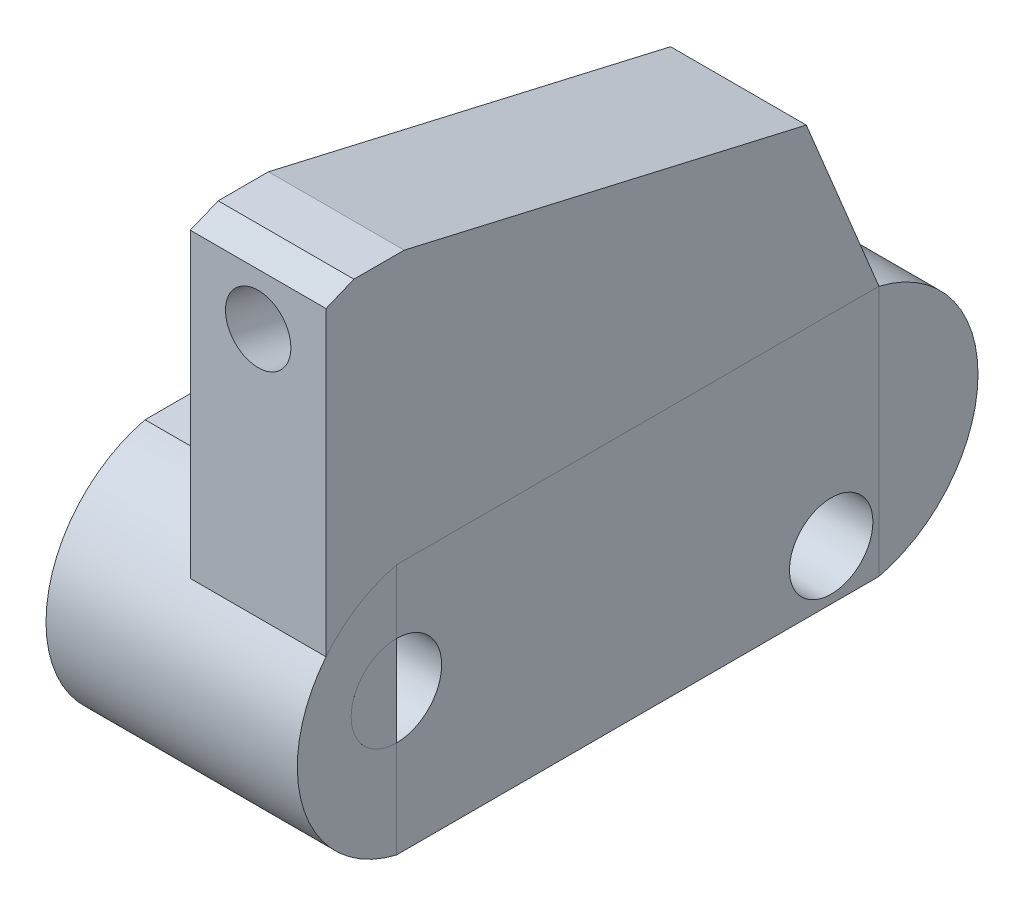
ISO-10303-21;
HEADER;
FILE_DESCRIPTION(('STEP AP214'),'2;1');
FILE_NAME('part.step','',(''),(''),'','','');
FILE_SCHEMA(('AUTOMOTIVE_DESIGN { 1 0 10303 214 1 1 1 1 }'));
ENDSEC;
DATA;
#1=APPLICATION_CONTEXT('core data for automotive mechanical design processes');
#2=APPLICATION_PROTOCOL_DEFINITION('international standard','automotive_design',2000,#1);
#3=PRODUCT_CONTEXT('',#1,'mechanical');
#4=PRODUCT('Part','Part','',(#3));
#5=PRODUCT_RELATED_PRODUCT_CATEGORY('part','',(#4));
#6=PRODUCT_DEFINITION_FORMATION('','',#4);
#7=PRODUCT_DEFINITION_CONTEXT('part definition',#1,'design');
#8=PRODUCT_DEFINITION('design','',#6,#7);
#9=PRODUCT_DEFINITION_SHAPE('','',#8);
#10=(LENGTH_UNIT() NAMED_UNIT(*) SI_UNIT(.MILLI.,.METRE.));
#11=(NAMED_UNIT(*) PLANE_ANGLE_UNIT() SI_UNIT($,.RADIAN.));
#12=(NAMED_UNIT(*) SI_UNIT($,.STERADIAN.) SOLID_ANGLE_UNIT());
#13=UNCERTAINTY_MEASURE_WITH_UNIT(LENGTH_MEASURE(1.E-05),#10,'distance_accuracy_value','');
#14=(GEOMETRIC_REPRESENTATION_CONTEXT(3) GLOBAL_UNCERTAINTY_ASSIGNED_CONTEXT((#13)) GLOBAL_UNIT_ASSIGNED_CONTEXT((#10,
#11,#12)) REPRESENTATION_CONTEXT('',''));
#15=CARTESIAN_POINT('',(0.,0.,0.));
#16=DIRECTION('',(0.,0.,1.));
#17=DIRECTION('',(1.,0.,0.));
#18=AXIS2_PLACEMENT_3D('',#15,#16,#17);
#19=CARTESIAN_POINT('',(0.,25.,0.));
#20=DIRECTION('',(0.,1.,0.));
#21=DIRECTION('',(0.,0.,1.));
#22=AXIS2_PLACEMENT_3D('',#19,#20,#21);
#23=PLANE('',#22);
#24=DIRECTION('',(1.,0.,0.));
#25=VECTOR('',#24,1.);
#26=CARTESIAN_POINT('',(-12.5,25.,24.));
#27=LINE('',#26,#25);
#28=CARTESIAN_POINT('',(-12.5,25.,24.));
#29=VERTEX_POINT('',#28);
#30=CARTESIAN_POINT('',(-0.999999999999999,25.,24.));
#31=VERTEX_POINT('',#30);
#32=EDGE_CURVE('E260',#29,#31,#27,.T.);
#33=ORIENTED_EDGE('',*,*,#32,.T.);
#34=DIRECTION('',(0.,0.,-1.));
#35=VECTOR('',#34,1.);
#36=CARTESIAN_POINT('',(-0.999999999999997,25.,24.));
#37=LINE('',#36,#35);
#38=CARTESIAN_POINT('',(-1.,25.,-24.));
#39=VERTEX_POINT('',#38);
#40=EDGE_CURVE('E66',#31,#39,#37,.T.);
#41=ORIENTED_EDGE('',*,*,#40,.T.);
#42=DIRECTION('',(-1.,0.,0.));
#43=VECTOR('',#42,1.);
#44=CARTESIAN_POINT('',(-12.5,25.,-24.));
#45=LINE('',#44,#43);
#46=CARTESIAN_POINT('',(-12.5,25.,-24.));
#47=VERTEX_POINT('',#46);
#48=EDGE_CURVE('E248',#39,#47,#45,.T.);
#49=ORIENTED_EDGE('',*,*,#48,.T.);
#50=DIRECTION('',(0.,0.,1.));
#51=VECTOR('',#50,1.);
#52=CARTESIAN_POINT('',(-12.5,25.,-24.));
#53=LINE('',#52,#51);
#54=EDGE_CURVE('E274',#47,#29,#53,.T.);
#55=ORIENTED_EDGE('',*,*,#54,.T.);
#56=EDGE_LOOP('',(#33,#41,#49,#55));
#57=FACE_BOUND('',#56,.T.);
#58=ADVANCED_FACE('F48',(#57),#23,.T.);
#59=CARTESIAN_POINT('',(12.500012,12.5,21.));
#60=DIRECTION('',(1.,0.,0.));
#61=DIRECTION('',(0.,0.,-1.));
#62=AXIS2_PLACEMENT_3D('',#59,#60,#61);
#63=PLANE('',#62);
#64=CARTESIAN_POINT('',(12.500012,14.15,24.));
#65=DIRECTION('',(1.,0.,0.));
#66=DIRECTION('',(0.,0.,-1.));
#67=AXIS2_PLACEMENT_3D('',#64,#65,#66);
#68=CIRCLE('',#67,4.5);
#69=CARTESIAN_POINT('',(12.5,18.65,24.));
#70=VERTEX_POINT('',#69);
#71=CARTESIAN_POINT('',(12.500006,9.65,24.));
#72=VERTEX_POINT('',#71);
#73=EDGE_CURVE('E12',#70,#72,#68,.T.);
#74=ORIENTED_EDGE('',*,*,#73,.F.);
#75=CARTESIAN_POINT('',(12.5,25.,24.));
#76=DIRECTION('',(0.,-1.,0.));
#77=VECTOR('',#76,1.);
#78=LINE('',#75,#77);
#79=CARTESIAN_POINT('',(12.500006,25.,24.));
#80=VERTEX_POINT('',#79);
#81=EDGE_CURVE('E214',#80,#70,#78,.T.);
#82=ORIENTED_EDGE('',*,*,#81,.F.);
#83=CARTESIAN_POINT('',(12.500012,12.5,21.));
#84=DIRECTION('',(1.,0.,0.));
#85=DIRECTION('',(0.,0.,-1.));
#86=AXIS2_PLACEMENT_3D('',#83,#84,#85);
#87=CIRCLE('',#86,12.8549601321824);
#88=CARTESIAN_POINT('',(12.500012,20.5777472107018,31.));
#89=VERTEX_POINT('',#88);
#90=EDGE_CURVE('E243',#80,#89,#87,.T.);
#91=ORIENTED_EDGE('',*,*,#90,.T.);
#92=CARTESIAN_POINT('',(12.500006,0.,24.));
#93=VERTEX_POINT('',#92);
#94=EDGE_CURVE('E208',#89,#93,#87,.T.);
#95=ORIENTED_EDGE('',*,*,#94,.T.);
#96=CARTESIAN_POINT('',(12.5,9.65,24.));
#97=DIRECTION('',(0.,-1.,0.));
#98=VECTOR('',#97,1.);
#99=LINE('',#96,#98);
#100=EDGE_CURVE('E213',#72,#93,#99,.T.);
#101=ORIENTED_EDGE('',*,*,#100,.F.);
#102=EDGE_LOOP('',(#74,#82,#91,#95,#101));
#103=FACE_BOUND('',#102,.T.);
#104=ADVANCED_FACE('F50',(#103),#63,.T.);
#105=CARTESIAN_POINT('',(-12.5,25.,-24.));
#106=DIRECTION('',(1.,0.,0.));
#107=DIRECTION('',(0.,0.,-1.));
#108=AXIS2_PLACEMENT_3D('',#105,#106,#107);
#109=PLANE('',#108);
#110=CARTESIAN_POINT('',(-12.5,14.15,24.));
#111=DIRECTION('',(1.,0.,0.));
#112=DIRECTION('',(0.,0.,-1.));
#113=AXIS2_PLACEMENT_3D('',#110,#111,#112);
#114=CIRCLE('',#113,4.5);
#115=CARTESIAN_POINT('',(-12.5,14.15,19.5));
#116=VERTEX_POINT('',#115);
#117=EDGE_CURVE('E300',#116,#116,#114,.T.);
#118=ORIENTED_EDGE('',*,*,#117,.T.);
#119=EDGE_LOOP('',(#118));
#120=FACE_BOUND('',#119,.T.);
#121=CARTESIAN_POINT('',(-12.5,5.,-19.25));
#122=DIRECTION('',(1.,0.,0.));
#123=DIRECTION('',(0.,0.,-1.));
#124=AXIS2_PLACEMENT_3D('',#121,#122,#123);
#125=CIRCLE('',#124,4.15);
#126=CARTESIAN_POINT('',(-12.5,5.,-23.4));
#127=VERTEX_POINT('',#126);
#128=EDGE_CURVE('E278',#127,#127,#125,.T.);
#129=ORIENTED_EDGE('',*,*,#128,.T.);
#130=EDGE_LOOP('',(#129));
#131=FACE_BOUND('',#130,.T.);
#132=DIRECTION('',(0.,0.,1.));
#133=VECTOR('',#132,1.);
#134=CARTESIAN_POINT('',(-12.5,0.,-24.));
#135=LINE('',#134,#133);
#136=CARTESIAN_POINT('',(-12.5,0.,-24.));
#137=VERTEX_POINT('',#136);
#138=CARTESIAN_POINT('',(-12.5,0.,24.));
#139=VERTEX_POINT('',#138);
#140=EDGE_CURVE('E275',#137,#139,#135,.T.);
#141=ORIENTED_EDGE('',*,*,#140,.T.);
#142=CARTESIAN_POINT('',(-12.5,12.5,21.));
#143=DIRECTION('',(1.,0.,0.));
#144=DIRECTION('',(0.,0.,-1.));
#145=AXIS2_PLACEMENT_3D('',#142,#143,#144);
#146=CIRCLE('',#145,12.8549601321824);
#147=EDGE_CURVE('E288',#29,#139,#146,.T.);
#148=ORIENTED_EDGE('',*,*,#147,.F.);
#149=ORIENTED_EDGE('',*,*,#54,.F.);
#150=CARTESIAN_POINT('',(-12.5,12.5,-21.));
#151=DIRECTION('',(1.,0.,0.));
#152=DIRECTION('',(0.,0.,1.));
#153=AXIS2_PLACEMENT_3D('',#150,#151,#152);
#154=CIRCLE('',#153,12.8549601321824);
#155=EDGE_CURVE('E239',#137,#47,#154,.T.);
#156=ORIENTED_EDGE('',*,*,#155,.F.);
#157=EDGE_LOOP('',(#141,#148,#149,#156));
#158=FACE_BOUND('',#157,.T.);
#159=ADVANCED_FACE('F305',(#120,#131,#158),#109,.F.);
#160=CARTESIAN_POINT('',(12.5,25.,-24.));
#161=DIRECTION('',(-1.,0.,0.));
#162=DIRECTION('',(0.,0.,1.));
#163=AXIS2_PLACEMENT_3D('',#160,#161,#162);
#164=PLANE('',#163);
#165=CARTESIAN_POINT('',(12.5,5.,-19.25));
#166=DIRECTION('',(1.,0.,0.));
#167=DIRECTION('',(0.,0.,-1.));
#168=AXIS2_PLACEMENT_3D('',#165,#166,#167);
#169=CIRCLE('',#168,4.15);
#170=CARTESIAN_POINT('',(12.5,5.,-23.4));
#171=VERTEX_POINT('',#170);
#172=EDGE_CURVE('E58',#171,#171,#169,.T.);
#173=ORIENTED_EDGE('',*,*,#172,.F.);
#174=EDGE_LOOP('',(#173));
#175=FACE_BOUND('',#174,.T.);
#176=ORIENTED_EDGE('',*,*,#81,.T.);
#177=CARTESIAN_POINT('',(12.5,14.15,24.));
#178=DIRECTION('',(-1.,0.,0.));
#179=DIRECTION('',(0.,0.,1.));
#180=AXIS2_PLACEMENT_3D('',#177,#178,#179);
#181=CIRCLE('',#180,4.5);
#182=EDGE_CURVE('E72',#70,#72,#181,.T.);
#183=ORIENTED_EDGE('',*,*,#182,.T.);
#184=ORIENTED_EDGE('',*,*,#100,.T.);
#185=DIRECTION('',(0.,0.,-1.));
#186=VECTOR('',#185,1.);
#187=CARTESIAN_POINT('',(12.5,0.,-24.));
#188=LINE('',#187,#186);
#189=CARTESIAN_POINT('',(12.5,0.,-24.));
#190=VERTEX_POINT('',#189);
#191=EDGE_CURVE('E272',#93,#190,#188,.T.);
#192=ORIENTED_EDGE('',*,*,#191,.T.);
#193=DIRECTION('',(0.,-1.,0.));
#194=VECTOR('',#193,1.);
#195=CARTESIAN_POINT('',(12.5,25.,-24.));
#196=LINE('',#195,#194);
#197=CARTESIAN_POINT('',(12.500006,25.,-24.));
#198=VERTEX_POINT('',#197);
#199=EDGE_CURVE('E256',#198,#190,#196,.T.);
#200=ORIENTED_EDGE('',*,*,#199,.F.);
#201=DIRECTION('',(0.,0.,-1.));
#202=VECTOR('',#201,1.);
#203=CARTESIAN_POINT('',(12.5,25.,-24.));
#204=LINE('',#203,#202);
#205=EDGE_CURVE('E151',#80,#198,#204,.T.);
#206=ORIENTED_EDGE('',*,*,#205,.F.);
#207=EDGE_LOOP('',(#176,#183,#184,#192,#200,#206));
#208=FACE_BOUND('',#207,.T.);
#209=ADVANCED_FACE('F356',(#175,#208),#164,.F.);
#210=CARTESIAN_POINT('',(0.,0.,0.));
#211=DIRECTION('',(0.,1.,0.));
#212=DIRECTION('',(0.,0.,1.));
#213=AXIS2_PLACEMENT_3D('',#210,#211,#212);
#214=PLANE('',#213);
#215=ORIENTED_EDGE('',*,*,#140,.F.);
#216=DIRECTION('',(-1.,0.,0.));
#217=VECTOR('',#216,1.);
#218=CARTESIAN_POINT('',(-12.5,0.,-24.));
#219=LINE('',#218,#217);
#220=EDGE_CURVE('E263',#190,#137,#219,.T.);
#221=ORIENTED_EDGE('',*,*,#220,.F.);
#222=ORIENTED_EDGE('',*,*,#191,.F.);
#223=DIRECTION('',(1.,0.,0.));
#224=VECTOR('',#223,1.);
#225=CARTESIAN_POINT('',(-12.5,0.,24.));
#226=LINE('',#225,#224);
#227=EDGE_CURVE('E293',#139,#93,#226,.T.);
#228=ORIENTED_EDGE('',*,*,#227,.F.);
#229=EDGE_LOOP('',(#215,#221,#222,#228));
#230=FACE_BOUND('',#229,.T.);
#231=ADVANCED_FACE('F330',(#230),#214,.F.);
#232=CARTESIAN_POINT('',(-12.5,25.,-24.));
#233=DIRECTION('',(0.,0.,1.));
#234=DIRECTION('',(1.,0.,0.));
#235=AXIS2_PLACEMENT_3D('',#232,#233,#234);
#236=PLANE('',#235);
#237=ORIENTED_EDGE('',*,*,#199,.T.);
#238=DIRECTION('',(0.,1.,0.));
#239=VECTOR('',#238,1.);
#240=CARTESIAN_POINT('',(12.500012,12.5,-24.));
#241=LINE('',#240,#239);
#242=EDGE_CURVE('E285',#198,#190,#241,.F.);
#243=ORIENTED_EDGE('',*,*,#242,.F.);
#244=EDGE_LOOP('',(#237,#243));
#245=FACE_BOUND('',#244,.T.);
#246=ADVANCED_FACE('F335',(#245),#236,.T.);
#247=CARTESIAN_POINT('',(-12.5,12.5,-21.));
#248=DIRECTION('',(1.,0.,0.));
#249=DIRECTION('',(0.,0.,-1.));
#250=AXIS2_PLACEMENT_3D('',#247,#248,#249);
#251=CYLINDRICAL_SURFACE('',#250,12.8549601321824);
#252=CARTESIAN_POINT('',(12.500012,12.5,-21.));
#253=DIRECTION('',(-1.,0.,0.));
#254=DIRECTION('',(0.,0.,1.));
#255=AXIS2_PLACEMENT_3D('',#252,#253,#254);
#256=CIRCLE('',#255,12.8549601321824);
#257=EDGE_CURVE('E282',#190,#198,#256,.F.);
#258=ORIENTED_EDGE('',*,*,#257,.F.);
#259=ORIENTED_EDGE('',*,*,#220,.T.);
#260=ORIENTED_EDGE('',*,*,#155,.T.);
#261=ORIENTED_EDGE('',*,*,#48,.F.);
#262=EDGE_CURVE('E250',#198,#39,#45,.T.);
#263=ORIENTED_EDGE('',*,*,#262,.F.);
#264=EDGE_LOOP('',(#258,#259,#260,#261,#263));
#265=FACE_BOUND('',#264,.T.);
#266=ADVANCED_FACE('F332',(#265),#251,.T.);
#267=CARTESIAN_POINT('',(12.500012,12.5,-21.));
#268=DIRECTION('',(-1.,0.,0.));
#269=DIRECTION('',(0.,0.,1.));
#270=AXIS2_PLACEMENT_3D('',#267,#268,#269);
#271=PLANE('',#270);
#272=ORIENTED_EDGE('',*,*,#257,.T.);
#273=ORIENTED_EDGE('',*,*,#242,.T.);
#274=EDGE_LOOP('',(#272,#273));
#275=FACE_BOUND('',#274,.T.);
#276=ADVANCED_FACE('F318',(#275),#271,.F.);
#277=CARTESIAN_POINT('',(-12.5,12.5,21.));
#278=DIRECTION('',(1.,0.,0.));
#279=DIRECTION('',(0.,0.,-1.));
#280=AXIS2_PLACEMENT_3D('',#277,#278,#279);
#281=CYLINDRICAL_SURFACE('',#280,12.8549601321824);
#282=DIRECTION('',(1.,0.,0.));
#283=VECTOR('',#282,1.);
#284=CARTESIAN_POINT('',(-0.999999999999997,20.5777472107018,31.));
#285=LINE('',#284,#283);
#286=CARTESIAN_POINT('',(-0.999999999999997,20.5777472107018,31.));
#287=VERTEX_POINT('',#286);
#288=EDGE_CURVE('E203',#287,#89,#285,.T.);
#289=ORIENTED_EDGE('',*,*,#288,.F.);
#290=CARTESIAN_POINT('',(-0.999999999999999,12.5,21.));
#291=DIRECTION('',(-1.,0.,0.));
#292=DIRECTION('',(0.,0.,-1.));
#293=AXIS2_PLACEMENT_3D('',#290,#291,#292);
#294=CIRCLE('',#293,12.8549601321824);
#295=EDGE_CURVE('E155',#287,#31,#294,.T.);
#296=ORIENTED_EDGE('',*,*,#295,.T.);
#297=ORIENTED_EDGE('',*,*,#32,.F.);
#298=ORIENTED_EDGE('',*,*,#147,.T.);
#299=ORIENTED_EDGE('',*,*,#227,.T.);
#300=ORIENTED_EDGE('',*,*,#94,.F.);
#301=EDGE_LOOP('',(#289,#296,#297,#298,#299,#300));
#302=FACE_BOUND('',#301,.T.);
#303=ADVANCED_FACE('F311',(#302),#281,.T.);
#304=CARTESIAN_POINT('',(-12.500025,5.,-19.25));
#305=DIRECTION('',(1.,0.,0.));
#306=DIRECTION('',(0.,0.,-1.));
#307=AXIS2_PLACEMENT_3D('',#304,#305,#306);
#308=CYLINDRICAL_SURFACE('',#307,4.15);
#309=ORIENTED_EDGE('',*,*,#172,.T.);
#310=EDGE_LOOP('',(#309));
#311=FACE_BOUND('',#310,.T.);
#312=ORIENTED_EDGE('',*,*,#128,.F.);
#313=EDGE_LOOP('',(#312));
#314=FACE_BOUND('',#313,.T.);
#315=ADVANCED_FACE('F308',(#311,#314),#308,.F.);
#316=CARTESIAN_POINT('',(-12.500025,14.15,24.));
#317=DIRECTION('',(1.,0.,0.));
#318=DIRECTION('',(0.,0.,-1.));
#319=AXIS2_PLACEMENT_3D('',#316,#317,#318);
#320=CYLINDRICAL_SURFACE('',#319,4.5);
#321=ORIENTED_EDGE('',*,*,#73,.T.);
#322=ORIENTED_EDGE('',*,*,#182,.F.);
#323=EDGE_LOOP('',(#321,#322));
#324=FACE_BOUND('',#323,.T.);
#325=ORIENTED_EDGE('',*,*,#117,.F.);
#326=EDGE_LOOP('',(#325));
#327=FACE_BOUND('',#326,.T.);
#328=ADVANCED_FACE('F310',(#324,#327),#320,.F.);
#329=CARTESIAN_POINT('',(-0.999999999999997,25.,24.));
#330=DIRECTION('',(0.,-1.,0.));
#331=DIRECTION('',(0.,0.,-1.));
#332=AXIS2_PLACEMENT_3D('',#329,#330,#331);
#333=PLANE('',#332);
#334=ORIENTED_EDGE('',*,*,#205,.T.);
#335=DIRECTION('',(1.,0.,0.));
#336=VECTOR('',#335,1.);
#337=CARTESIAN_POINT('',(-1.,25.,-24.));
#338=LINE('',#337,#336);
#339=CARTESIAN_POINT('',(12.500286,25.,-24.));
#340=VERTEX_POINT('',#339);
#341=EDGE_CURVE('E144',#198,#340,#338,.T.);
#342=ORIENTED_EDGE('',*,*,#341,.T.);
#343=DIRECTION('',(0.,0.,-1.));
#344=VECTOR('',#343,1.);
#345=CARTESIAN_POINT('',(12.500286,25.,24.));
#346=LINE('',#345,#344);
#347=CARTESIAN_POINT('',(12.500286,25.,24.));
#348=VERTEX_POINT('',#347);
#349=EDGE_CURVE('E149',#348,#340,#346,.T.);
#350=ORIENTED_EDGE('',*,*,#349,.F.);
#351=DIRECTION('',(1.,0.,0.));
#352=VECTOR('',#351,1.);
#353=CARTESIAN_POINT('',(-0.999999999999999,25.,24.));
#354=LINE('',#353,#352);
#355=EDGE_CURVE('E206',#80,#348,#354,.T.);
#356=ORIENTED_EDGE('',*,*,#355,.F.);
#357=EDGE_LOOP('',(#334,#342,#350,#356));
#358=FACE_BOUND('',#357,.T.);
#359=ADVANCED_FACE('F146',(#358),#333,.T.);
#360=CARTESIAN_POINT('',(-0.999999999999999,12.5,21.));
#361=DIRECTION('',(1.,0.,0.));
#362=DIRECTION('',(0.,0.,-1.));
#363=AXIS2_PLACEMENT_3D('',#360,#361,#362);
#364=CYLINDRICAL_SURFACE('',#363,12.8549601321824);
#365=CARTESIAN_POINT('',(12.500286,20.5777472107018,31.));
#366=VERTEX_POINT('',#365);
#367=EDGE_CURVE('E412',#89,#366,#285,.T.);
#368=ORIENTED_EDGE('',*,*,#367,.F.);
#369=ORIENTED_EDGE('',*,*,#90,.F.);
#370=ORIENTED_EDGE('',*,*,#355,.T.);
#371=CARTESIAN_POINT('',(12.500286,12.5,21.));
#372=DIRECTION('',(-1.,0.,0.));
#373=DIRECTION('',(0.,0.,-1.));
#374=AXIS2_PLACEMENT_3D('',#371,#372,#373);
#375=CIRCLE('',#374,12.8549601321824);
#376=EDGE_CURVE('E170',#366,#348,#375,.T.);
#377=ORIENTED_EDGE('',*,*,#376,.F.);
#378=EDGE_LOOP('',(#368,#369,#370,#377));
#379=FACE_BOUND('',#378,.T.);
#380=ADVANCED_FACE('F371',(#379),#364,.F.);
#381=CARTESIAN_POINT('',(-0.999999999999997,50.5777472107018,31.));
#382=DIRECTION('',(0.,0.,1.));
#383=DIRECTION('',(1.,0.,0.));
#384=AXIS2_PLACEMENT_3D('',#381,#382,#383);
#385=PLANE('',#384);
#386=CARTESIAN_POINT('',(5.75,45.4465596723574,31.));
#387=DIRECTION('',(0.,0.,1.));
#388=DIRECTION('',(0.,1.,0.));
#389=AXIS2_PLACEMENT_3D('',#386,#387,#388);
#390=ELLIPSE('',#389,3.33527189992382,3.25);
#391=CARTESIAN_POINT('',(5.75,48.7818315722813,31.));
#392=VERTEX_POINT('',#391);
#393=EDGE_CURVE('E171',#392,#392,#390,.T.);
#394=ORIENTED_EDGE('',*,*,#393,.F.);
#395=EDGE_LOOP('',(#394));
#396=FACE_BOUND('',#395,.T.);
#397=ORIENTED_EDGE('',*,*,#288,.T.);
#398=ORIENTED_EDGE('',*,*,#367,.T.);
#399=DIRECTION('',(0.,-1.,0.));
#400=VECTOR('',#399,1.);
#401=CARTESIAN_POINT('',(12.500286,50.5777472107018,31.));
#402=LINE('',#401,#400);
#403=CARTESIAN_POINT('',(12.500286,50.5777472107018,31.));
#404=VERTEX_POINT('',#403);
#405=EDGE_CURVE('E183',#404,#366,#402,.T.);
#406=ORIENTED_EDGE('',*,*,#405,.F.);
#407=DIRECTION('',(1.,0.,0.));
#408=VECTOR('',#407,1.);
#409=CARTESIAN_POINT('',(-0.999999999999997,50.5777472107018,31.));
#410=LINE('',#409,#408);
#411=CARTESIAN_POINT('',(-0.999999999999997,50.5777472107018,31.));
#412=VERTEX_POINT('',#411);
#413=EDGE_CURVE('E586',#412,#404,#410,.T.);
#414=ORIENTED_EDGE('',*,*,#413,.F.);
#415=DIRECTION('',(0.,-1.,0.));
#416=VECTOR('',#415,1.);
#417=CARTESIAN_POINT('',(-0.999999999999997,50.5777472107018,31.));
#418=LINE('',#417,#416);
#419=EDGE_CURVE('E198',#412,#287,#418,.T.);
#420=ORIENTED_EDGE('',*,*,#419,.T.);
#421=EDGE_LOOP('',(#397,#398,#406,#414,#420));
#422=FACE_BOUND('',#421,.T.);
#423=ADVANCED_FACE('F386',(#396,#422),#385,.T.);
#424=CARTESIAN_POINT('',(-0.999999999999997,51.7228778282187,28.2271538324629));
#425=DIRECTION('',(0.,0.924282055845709,0.381710205838971));
#426=DIRECTION('',(0.,-0.381710205838971,0.924282055845709));
#427=AXIS2_PLACEMENT_3D('',#424,#425,#426);
#428=PLANE('',#427);
#429=ORIENTED_EDGE('',*,*,#413,.T.);
#430=DIRECTION('',(0.,-0.381710205838971,0.924282055845709));
#431=VECTOR('',#430,1.);
#432=CARTESIAN_POINT('',(12.500286,51.7228778282187,28.2271538324629));
#433=LINE('',#432,#431);
#434=CARTESIAN_POINT('',(12.500286,51.7228778282187,28.2271538324629));
#435=VERTEX_POINT('',#434);
#436=EDGE_CURVE('E180',#435,#404,#433,.T.);
#437=ORIENTED_EDGE('',*,*,#436,.F.);
#438=DIRECTION('',(1.,0.,0.));
#439=VECTOR('',#438,1.);
#440=CARTESIAN_POINT('',(-0.999999999999997,51.7228778282187,28.2271538324629));
#441=LINE('',#440,#439);
#442=CARTESIAN_POINT('',(-0.999999999999997,51.7228778282187,28.2271538324629));
#443=VERTEX_POINT('',#442);
#444=EDGE_CURVE('E587',#443,#435,#441,.T.);
#445=ORIENTED_EDGE('',*,*,#444,.F.);
#446=DIRECTION('',(0.,-0.381710205838971,0.924282055845709));
#447=VECTOR('',#446,1.);
#448=CARTESIAN_POINT('',(-0.999999999999997,51.7228778282187,28.2271538324629));
#449=LINE('',#448,#447);
#450=EDGE_CURVE('E195',#443,#412,#449,.T.);
#451=ORIENTED_EDGE('',*,*,#450,.T.);
#452=EDGE_LOOP('',(#429,#437,#445,#451));
#453=FACE_BOUND('',#452,.T.);
#454=ADVANCED_FACE('F382',(#453),#428,.T.);
#455=CARTESIAN_POINT('',(-0.999999999999999,51.7228778282187,23.2271538324629));
#456=DIRECTION('',(0.,1.,0.));
#457=DIRECTION('',(0.,0.,1.));
#458=AXIS2_PLACEMENT_3D('',#455,#456,#457);
#459=PLANE('',#458);
#460=ORIENTED_EDGE('',*,*,#444,.T.);
#461=DIRECTION('',(0.,0.,1.));
#462=VECTOR('',#461,1.);
#463=CARTESIAN_POINT('',(12.500286,51.7228778282187,23.2271538324629));
#464=LINE('',#463,#462);
#465=CARTESIAN_POINT('',(12.500286,51.7228778282187,23.2271538324629));
#466=VERTEX_POINT('',#465);
#467=EDGE_CURVE('E177',#466,#435,#464,.T.);
#468=ORIENTED_EDGE('',*,*,#467,.F.);
#469=DIRECTION('',(1.,0.,0.));
#470=VECTOR('',#469,1.);
#471=CARTESIAN_POINT('',(-0.999999999999999,51.7228778282187,23.2271538324629));
#472=LINE('',#471,#470);
#473=CARTESIAN_POINT('',(-0.999999999999999,51.7228778282187,23.2271538324629));
#474=VERTEX_POINT('',#473);
#475=EDGE_CURVE('E589',#474,#466,#472,.T.);
#476=ORIENTED_EDGE('',*,*,#475,.F.);
#477=DIRECTION('',(0.,0.,1.));
#478=VECTOR('',#477,1.);
#479=CARTESIAN_POINT('',(-0.999999999999999,51.7228778282187,23.2271538324629));
#480=LINE('',#479,#478);
#481=EDGE_CURVE('E192',#474,#443,#480,.T.);
#482=ORIENTED_EDGE('',*,*,#481,.T.);
#483=EDGE_LOOP('',(#460,#468,#476,#482));
#484=FACE_BOUND('',#483,.T.);
#485=ADVANCED_FACE('F378',(#484),#459,.T.);
#486=CARTESIAN_POINT('',(-0.999999999999999,42.5,-16.7728461675371));
#487=DIRECTION('',(0.,0.97443329884866,-0.224676981675732));
#488=DIRECTION('',(0.,0.224676981675732,0.97443329884866));
#489=AXIS2_PLACEMENT_3D('',#486,#487,#488);
#490=PLANE('',#489);
#491=ORIENTED_EDGE('',*,*,#475,.T.);
#492=DIRECTION('',(0.,0.224676981675732,0.97443329884866));
#493=VECTOR('',#492,1.);
#494=CARTESIAN_POINT('',(12.500286,42.5,-16.7728461675371));
#495=LINE('',#494,#493);
#496=CARTESIAN_POINT('',(12.500286,42.5,-16.7728461675371));
#497=VERTEX_POINT('',#496);
#498=EDGE_CURVE('E164',#497,#466,#495,.T.);
#499=ORIENTED_EDGE('',*,*,#498,.F.);
#500=DIRECTION('',(1.,0.,0.));
#501=VECTOR('',#500,1.);
#502=CARTESIAN_POINT('',(-0.999999999999999,42.5,-16.7728461675371));
#503=LINE('',#502,#501);
#504=CARTESIAN_POINT('',(-0.999999999999999,42.5,-16.7728461675371));
#505=VERTEX_POINT('',#504);
#506=EDGE_CURVE('E154',#505,#497,#503,.T.);
#507=ORIENTED_EDGE('',*,*,#506,.F.);
#508=DIRECTION('',(0.,0.224676981675732,0.97443329884866));
#509=VECTOR('',#508,1.);
#510=CARTESIAN_POINT('',(-0.999999999999999,42.5,-16.7728461675371));
#511=LINE('',#510,#509);
#512=EDGE_CURVE('E189',#505,#474,#511,.T.);
#513=ORIENTED_EDGE('',*,*,#512,.T.);
#514=EDGE_LOOP('',(#491,#499,#507,#513));
#515=FACE_BOUND('',#514,.T.);
#516=ADVANCED_FACE('F374',(#515),#490,.T.);
#517=CARTESIAN_POINT('',(-1.,25.,-24.));
#518=DIRECTION('',(0.,0.38171020583897,-0.924282055845709));
#519=DIRECTION('',(0.,0.924282055845709,0.38171020583897));
#520=AXIS2_PLACEMENT_3D('',#517,#518,#519);
#521=PLANE('',#520);
#522=CARTESIAN_POINT('',(5.75,33.5823259156756,-20.4556691638331));
#523=DIRECTION('',(0.,0.38171020583897,-0.924282055845709));
#524=DIRECTION('',(0.,0.924282055845709,0.38171020583897));
#525=AXIS2_PLACEMENT_3D('',#522,#523,#524);
#526=ELLIPSE('',#525,3.98826974607613,3.25);
#527=CARTESIAN_POINT('',(5.75,37.2686120758461,-18.9333058981171));
#528=VERTEX_POINT('',#527);
#529=EDGE_CURVE('E53',#528,#528,#526,.T.);
#530=ORIENTED_EDGE('',*,*,#529,.F.);
#531=EDGE_LOOP('',(#530));
#532=FACE_BOUND('',#531,.T.);
#533=ORIENTED_EDGE('',*,*,#506,.T.);
#534=DIRECTION('',(0.,0.924282055845709,0.38171020583897));
#535=VECTOR('',#534,1.);
#536=CARTESIAN_POINT('',(12.500286,25.,-24.));
#537=LINE('',#536,#535);
#538=EDGE_CURVE('E158',#340,#497,#537,.T.);
#539=ORIENTED_EDGE('',*,*,#538,.F.);
#540=ORIENTED_EDGE('',*,*,#341,.F.);
#541=ORIENTED_EDGE('',*,*,#262,.T.);
#542=DIRECTION('',(0.,0.924282055845709,0.38171020583897));
#543=VECTOR('',#542,1.);
#544=CARTESIAN_POINT('',(-1.,25.,-24.));
#545=LINE('',#544,#543);
#546=EDGE_CURVE('E187',#39,#505,#545,.T.);
#547=ORIENTED_EDGE('',*,*,#546,.T.);
#548=EDGE_LOOP('',(#533,#539,#540,#541,#547));
#549=FACE_BOUND('',#548,.T.);
#550=ADVANCED_FACE('F159',(#532,#549),#521,.T.);
#551=CARTESIAN_POINT('',(-0.999999999999999,12.5,21.));
#552=DIRECTION('',(1.,0.,0.));
#553=DIRECTION('',(0.,0.,-1.));
#554=AXIS2_PLACEMENT_3D('',#551,#552,#553);
#555=PLANE('',#554);
#556=ORIENTED_EDGE('',*,*,#40,.F.);
#557=ORIENTED_EDGE('',*,*,#295,.F.);
#558=ORIENTED_EDGE('',*,*,#419,.F.);
#559=ORIENTED_EDGE('',*,*,#450,.F.);
#560=ORIENTED_EDGE('',*,*,#481,.F.);
#561=ORIENTED_EDGE('',*,*,#512,.F.);
#562=ORIENTED_EDGE('',*,*,#546,.F.);
#563=EDGE_LOOP('',(#556,#557,#558,#559,#560,#561,#562));
#564=FACE_BOUND('',#563,.T.);
#565=ADVANCED_FACE('F347',(#564),#555,.F.);
#566=CARTESIAN_POINT('',(12.500286,12.5,21.));
#567=DIRECTION('',(1.,0.,0.));
#568=DIRECTION('',(0.,0.,-1.));
#569=AXIS2_PLACEMENT_3D('',#566,#567,#568);
#570=PLANE('',#569);
#571=ORIENTED_EDGE('',*,*,#349,.T.);
#572=ORIENTED_EDGE('',*,*,#538,.T.);
#573=ORIENTED_EDGE('',*,*,#498,.T.);
#574=ORIENTED_EDGE('',*,*,#467,.T.);
#575=ORIENTED_EDGE('',*,*,#436,.T.);
#576=ORIENTED_EDGE('',*,*,#405,.T.);
#577=ORIENTED_EDGE('',*,*,#376,.T.);
#578=EDGE_LOOP('',(#571,#572,#573,#574,#575,#576,#577));
#579=FACE_BOUND('',#578,.T.);
#580=ADVANCED_FACE('F167',(#579),#570,.T.);
#581=CARTESIAN_POINT('',(5.75,28.9535356382078,-40.5309227394814));
#582=DIRECTION('',(0.,0.224676981675732,0.97443329884866));
#583=DIRECTION('',(0.,-0.97443329884866,0.224676981675732));
#584=AXIS2_PLACEMENT_3D('',#581,#582,#583);
#585=CYLINDRICAL_SURFACE('',#584,3.25);
#586=ORIENTED_EDGE('',*,*,#393,.T.);
#587=EDGE_LOOP('',(#586));
#588=FACE_BOUND('',#587,.T.);
#589=ORIENTED_EDGE('',*,*,#529,.T.);
#590=EDGE_LOOP('',(#589));
#591=FACE_BOUND('',#590,.T.);
#592=ADVANCED_FACE('F398',(#588,#591),#585,.F.);
#593=CLOSED_SHELL('',(#58,#104,#159,#209,#231,#246,#266,#276,#303,#315,#328,#359,#380,#423,#454,
#485,#516,#550,#565,#580,#592));
#594=MANIFOLD_SOLID_BREP('B2',#593);
#595=CARTESIAN_POINT('',(12.500012,12.5,21.));
#596=DIRECTION('',(1.,0.,0.));
#597=DIRECTION('',(0.,0.,-1.));
#598=AXIS2_PLACEMENT_3D('',#595,#596,#597);
#599=PLANE('',#598);
#600=CARTESIAN_POINT('',(12.5,18.65,24.));
#601=DIRECTION('',(0.,-1.,0.));
#602=VECTOR('',#601,1.);
#603=LINE('',#600,#602);
#604=CARTESIAN_POINT('',(12.500006,18.65,24.));
#605=VERTEX_POINT('',#604);
#606=CARTESIAN_POINT('',(12.5,9.65,24.));
#607=VERTEX_POINT('',#606);
#608=EDGE_CURVE('E46',#605,#607,#603,.T.);
#609=ORIENTED_EDGE('',*,*,#608,.F.);
#610=CARTESIAN_POINT('',(12.500012,18.65,24.));
#611=CARTESIAN_POINT('',(12.500012,18.65,24.2207948177519));
#612=CARTESIAN_POINT('',(12.500012,18.6283312700249,24.441077131483));
#613=CARTESIAN_POINT('',(12.500012,18.606743272562,24.6605387259284));
#614=CARTESIAN_POINT('',(12.500012,18.5635337618145,24.8779064490726));
#615=CARTESIAN_POINT('',(12.500012,18.5205387185598,25.0941952821816));
#616=CARTESIAN_POINT('',(12.500012,18.4562315107949,25.3062810476451));
#617=CARTESIAN_POINT('',(12.500012,18.392243487518,25.5173141397181));
#618=CARTESIAN_POINT('',(12.500012,18.3074578963008,25.7220754456429));
#619=CARTESIAN_POINT('',(12.500012,18.223093132645,25.9258204326412));
#620=CARTESIAN_POINT('',(12.500012,18.1186456895676,26.121285315717));
#621=CARTESIAN_POINT('',(12.500012,18.0147166643248,26.3157800220375));
#622=CARTESIAN_POINT('',(12.500012,17.8916132553615,26.5000660485882));
#623=CARTESIAN_POINT('',(12.500012,17.769120861861,26.6834373838826));
#624=CARTESIAN_POINT('',(12.500012,17.6285470401323,26.8547697787364));
#625=CARTESIAN_POINT('',(12.500012,17.4886709470843,27.025251776807));
#626=CARTESIAN_POINT('',(12.500012,17.3319805153395,27.1819805153395));
#627=CARTESIAN_POINT('',(12.500012,17.1760678059819,27.3379313413516));
#628=CARTESIAN_POINT('',(12.500012,17.0047697787364,27.4785470401323));
#629=CARTESIAN_POINT('',(12.500012,16.8343219776968,27.6184648023753));
#630=CARTESIAN_POINT('',(12.500012,16.6500660485882,27.7416132553615));
#631=CARTESIAN_POINT('',(12.500012,16.4667246613601,27.8641504693046));
#632=CARTESIAN_POINT('',(12.500012,16.271285315717,27.9686456895676));
#633=CARTESIAN_POINT('',(12.500012,16.0768160200775,28.0726222548563));
#634=CARTESIAN_POINT('',(12.500012,15.8720754456429,28.1574578963008));
#635=CARTESIAN_POINT('',(12.500012,15.6683510872299,28.2418724617653));
#636=CARTESIAN_POINT('',(12.500012,15.4562810476451,28.3062315107949));
#637=CARTESIAN_POINT('',(12.500012,15.2452636033947,28.3702711180267));
#638=CARTESIAN_POINT('',(12.500012,15.0279064490726,28.4135337618145));
#639=CARTESIAN_POINT('',(12.500012,14.8116281323215,28.4565816743888));
#640=CARTESIAN_POINT('',(12.500012,14.591077131483,28.4783312700249));
#641=CARTESIAN_POINT('',(12.500012,14.3716208206507,28.4999729130111));
#642=CARTESIAN_POINT('',(12.500012,14.15,28.5));
#643=CARTESIAN_POINT('',(12.500012,13.9294791793287,28.5000269525445));
#644=CARTESIAN_POINT('',(12.500012,13.708922868517,28.4783312700249));
#645=CARTESIAN_POINT('',(12.500012,13.4894612740642,28.4567432725608));
#646=CARTESIAN_POINT('',(12.500012,13.2720935509274,28.4135337618145));
#647=CARTESIAN_POINT('',(12.500012,13.0558047178151,28.3705387185588));
#648=CARTESIAN_POINT('',(12.500012,12.8437189523549,28.3062315107949));
#649=CARTESIAN_POINT('',(12.500012,12.6326858602778,28.2422434875167));
#650=CARTESIAN_POINT('',(12.500012,12.4279245543571,28.1574578963008));
#651=CARTESIAN_POINT('',(12.500012,12.2241795673572,28.073093132644));
#652=CARTESIAN_POINT('',(12.500012,12.028714684283,27.9686456895676));
#653=CARTESIAN_POINT('',(12.500012,11.8342199779656,27.8647166643266));
#654=CARTESIAN_POINT('',(12.500012,11.6499339514118,27.7416132553615));
#655=CARTESIAN_POINT('',(12.500012,11.466562616119,27.6191208618623));
#656=CARTESIAN_POINT('',(12.500012,11.2952302212636,27.4785470401323));
#657=CARTESIAN_POINT('',(12.500012,11.1247482231891,27.3386709470811));
#658=CARTESIAN_POINT('',(12.500012,10.9680194846605,27.1819805153395));
#659=CARTESIAN_POINT('',(12.500012,10.812068658642,27.0260678059748));
#660=CARTESIAN_POINT('',(12.500012,10.6714529598677,26.8547697787364));
#661=CARTESIAN_POINT('',(12.500012,10.5315351976159,26.6843219776854));
#662=CARTESIAN_POINT('',(12.500012,10.4083867446385,26.5000660485882));
#663=CARTESIAN_POINT('',(12.500012,10.2858495306923,26.3167246613538));
#664=CARTESIAN_POINT('',(12.500012,10.1813543104324,26.121285315717));
#665=CARTESIAN_POINT('',(12.500012,10.0773777451464,25.9268160200831));
#666=CARTESIAN_POINT('',(12.500012,9.99254210369921,25.7220754456429));
#667=CARTESIAN_POINT('',(12.500012,9.9081275382344,25.5183510872299));
#668=CARTESIAN_POINT('',(12.500012,9.84376848920506,25.3062810476451));
#669=CARTESIAN_POINT('',(12.500012,9.77972888197267,25.0952636033914));
#670=CARTESIAN_POINT('',(12.500012,9.73646623818546,24.8779064490726));
#671=CARTESIAN_POINT('',(12.500012,9.69341832561129,24.6616281323218));
#672=CARTESIAN_POINT('',(12.500012,9.67166872997511,24.441077131483));
#673=CARTESIAN_POINT('',(12.500012,9.66088143391285,24.3316889395059));
#674=CARTESIAN_POINT('',(12.500012,9.65542044707672,24.2208045344734));
#675=CARTESIAN_POINT('',(12.500012,9.65,24.1107432823319));
#676=CARTESIAN_POINT('',(12.500012,9.65,24.));
#677=B_SPLINE_CURVE_WITH_KNOTS('',2,(#610,#611,#612,#613,#614,#615,#616,#617,#618,#619,#620,
#621,#622,#623,#624,#625,#626,#627,#628,#629,#630,#631,#632,#633,#634,#635,#636,#637,#638,#639,
#640,#641,#642,#643,#644,#645,#646,#647,#648,#649,#650,#651,#652,#653,#654,#655,#656,#657,#658,
#659,#660,#661,#662,#663,#664,#665,#666,#667,#668,#669,#670,#671,#672,#673,#674,#675,#676),
.UNSPECIFIED.,.F.,.F.,(3,2,2,2,2,2,2,2,2,2,2,2,2,2,2,2,2,2,2,2,2,2,2,2,2,2,2,2,2,2,2,2,2,3),(0.,
0.03125,0.0625,0.09375,0.125,0.15625,0.1875,0.21875,0.25,0.28125,0.3125,0.34375,0.375,0.40625,
0.4375,0.46875,0.5,0.53125,0.5625,0.59375,0.625,0.65625,0.6875,0.71875,0.75,0.78125,0.8125,
0.84375,0.875,0.90625,0.9375,0.96875,0.984375,1.),.UNSPECIFIED.);
#678=EDGE_CURVE('E612',#605,#607,#677,.T.);
#679=ORIENTED_EDGE('',*,*,#678,.T.);
#680=EDGE_LOOP('',(#609,#679));
#681=FACE_BOUND('',#680,.T.);
#682=ADVANCED_FACE('F602',(#681),#599,.T.);
#683=CARTESIAN_POINT('',(12.5,14.15,24.));
#684=DIRECTION('',(1.,0.,0.));
#685=DIRECTION('',(0.,0.,-1.));
#686=AXIS2_PLACEMENT_3D('',#683,#684,#685);
#687=PLANE('',#686);
#688=ORIENTED_EDGE('',*,*,#608,.T.);
#689=ORIENTED_EDGE('',*,*,#678,.F.);
#690=EDGE_LOOP('',(#688,#689));
#691=FACE_BOUND('',#690,.T.);
#692=ADVANCED_FACE('F620',(#691),#687,.F.);
#693=CLOSED_SHELL('',(#682,#692));
#694=MANIFOLD_SOLID_BREP('B6',#693);
#695=ADVANCED_BREP_SHAPE_REPRESENTATION('',(#18,#594,#694),#14);
#696=SHAPE_DEFINITION_REPRESENTATION(#9,#695);
ENDSEC;
END-ISO-10303-21;
